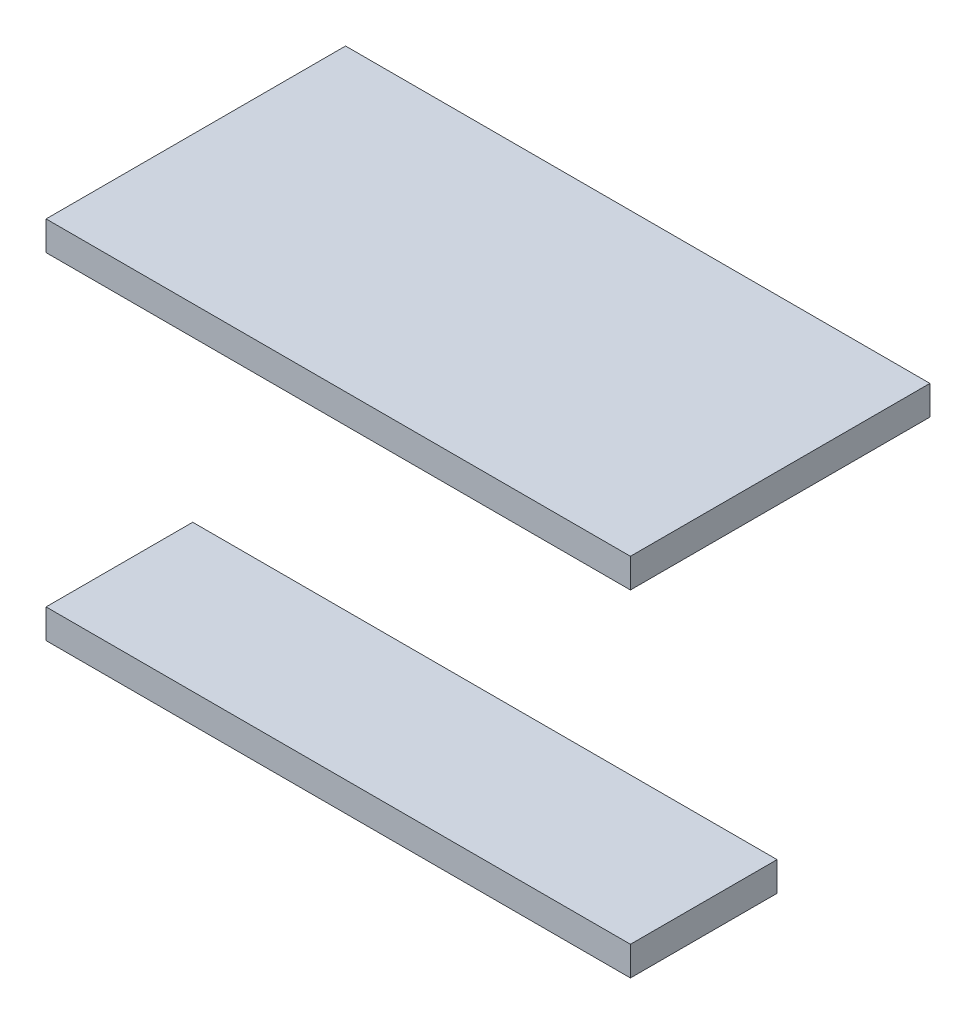
ISO-10303-21;
HEADER;
FILE_DESCRIPTION(('STEP AP214'),'2;1');
FILE_NAME('part.step','',(''),(''),'','','');
FILE_SCHEMA(('AUTOMOTIVE_DESIGN { 1 0 10303 214 1 1 1 1 }'));
ENDSEC;
DATA;
#1=APPLICATION_CONTEXT('core data for automotive mechanical design processes');
#2=APPLICATION_PROTOCOL_DEFINITION('international standard','automotive_design',2000,#1);
#3=PRODUCT_CONTEXT('',#1,'mechanical');
#4=PRODUCT('Part','Part','',(#3));
#5=PRODUCT_RELATED_PRODUCT_CATEGORY('part','',(#4));
#6=PRODUCT_DEFINITION_FORMATION('','',#4);
#7=PRODUCT_DEFINITION_CONTEXT('part definition',#1,'design');
#8=PRODUCT_DEFINITION('design','',#6,#7);
#9=PRODUCT_DEFINITION_SHAPE('','',#8);
#10=(LENGTH_UNIT() NAMED_UNIT(*) SI_UNIT(.MILLI.,.METRE.));
#11=(NAMED_UNIT(*) PLANE_ANGLE_UNIT() SI_UNIT($,.RADIAN.));
#12=(NAMED_UNIT(*) SI_UNIT($,.STERADIAN.) SOLID_ANGLE_UNIT());
#13=UNCERTAINTY_MEASURE_WITH_UNIT(LENGTH_MEASURE(1.E-05),#10,'distance_accuracy_value','');
#14=(GEOMETRIC_REPRESENTATION_CONTEXT(3) GLOBAL_UNCERTAINTY_ASSIGNED_CONTEXT((#13)) GLOBAL_UNIT_ASSIGNED_CONTEXT((#10,
#11,#12)) REPRESENTATION_CONTEXT('',''));
#15=CARTESIAN_POINT('',(0.,0.,0.));
#16=DIRECTION('',(0.,0.,1.));
#17=DIRECTION('',(1.,0.,0.));
#18=AXIS2_PLACEMENT_3D('',#15,#16,#17);
#19=CARTESIAN_POINT('',(-240.,0.,-12.));
#20=DIRECTION('',(0.,1.,0.));
#21=DIRECTION('',(0.,0.,1.));
#22=AXIS2_PLACEMENT_3D('',#19,#20,#21);
#23=PLANE('',#22);
#24=DIRECTION('',(0.,0.,1.));
#25=VECTOR('',#24,1.);
#26=CARTESIAN_POINT('',(0.,0.,-12.));
#27=LINE('',#26,#25);
#28=CARTESIAN_POINT('',(0.,0.,-135.));
#29=VERTEX_POINT('',#28);
#30=CARTESIAN_POINT('',(0.,0.,-12.));
#31=VERTEX_POINT('',#30);
#32=EDGE_CURVE('E107',#29,#31,#27,.T.);
#33=ORIENTED_EDGE('',*,*,#32,.F.);
#34=DIRECTION('',(1.,0.,0.));
#35=VECTOR('',#34,1.);
#36=CARTESIAN_POINT('',(-240.,0.,-135.));
#37=LINE('',#36,#35);
#38=CARTESIAN_POINT('',(-240.,0.,-135.));
#39=VERTEX_POINT('',#38);
#40=EDGE_CURVE('E12',#39,#29,#37,.T.);
#41=ORIENTED_EDGE('',*,*,#40,.F.);
#42=DIRECTION('',(0.,0.,1.));
#43=VECTOR('',#42,1.);
#44=CARTESIAN_POINT('',(-240.,0.,-12.));
#45=LINE('',#44,#43);
#46=CARTESIAN_POINT('',(-240.,0.,-12.));
#47=VERTEX_POINT('',#46);
#48=EDGE_CURVE('E101',#39,#47,#45,.T.);
#49=ORIENTED_EDGE('',*,*,#48,.T.);
#50=DIRECTION('',(1.,0.,0.));
#51=VECTOR('',#50,1.);
#52=CARTESIAN_POINT('',(-240.,0.,-12.));
#53=LINE('',#52,#51);
#54=EDGE_CURVE('E46',#47,#31,#53,.T.);
#55=ORIENTED_EDGE('',*,*,#54,.T.);
#56=EDGE_LOOP('',(#33,#41,#49,#55));
#57=FACE_BOUND('',#56,.T.);
#58=ADVANCED_FACE('F43',(#57),#23,.T.);
#59=CARTESIAN_POINT('',(-240.,0.,-135.));
#60=DIRECTION('',(0.,0.,-1.));
#61=DIRECTION('',(-1.,0.,0.));
#62=AXIS2_PLACEMENT_3D('',#59,#60,#61);
#63=PLANE('',#62);
#64=DIRECTION('',(0.,1.,0.));
#65=VECTOR('',#64,1.);
#66=CARTESIAN_POINT('',(0.,0.,-135.));
#67=LINE('',#66,#65);
#68=CARTESIAN_POINT('',(0.,-12.,-135.));
#69=VERTEX_POINT('',#68);
#70=EDGE_CURVE('E103',#69,#29,#67,.T.);
#71=ORIENTED_EDGE('',*,*,#70,.F.);
#72=DIRECTION('',(1.,0.,0.));
#73=VECTOR('',#72,1.);
#74=CARTESIAN_POINT('',(-240.,-12.,-135.));
#75=LINE('',#74,#73);
#76=CARTESIAN_POINT('',(-240.,-12.,-135.));
#77=VERTEX_POINT('',#76);
#78=EDGE_CURVE('E52',#77,#69,#75,.T.);
#79=ORIENTED_EDGE('',*,*,#78,.F.);
#80=DIRECTION('',(0.,1.,0.));
#81=VECTOR('',#80,1.);
#82=CARTESIAN_POINT('',(-240.,0.,-135.));
#83=LINE('',#82,#81);
#84=EDGE_CURVE('E98',#77,#39,#83,.T.);
#85=ORIENTED_EDGE('',*,*,#84,.T.);
#86=ORIENTED_EDGE('',*,*,#40,.T.);
#87=EDGE_LOOP('',(#71,#79,#85,#86));
#88=FACE_BOUND('',#87,.T.);
#89=ADVANCED_FACE('F117',(#88),#63,.T.);
#90=CARTESIAN_POINT('',(-240.,-12.,-12.));
#91=DIRECTION('',(0.,-1.,0.));
#92=DIRECTION('',(0.,0.,-1.));
#93=AXIS2_PLACEMENT_3D('',#90,#91,#92);
#94=PLANE('',#93);
#95=DIRECTION('',(0.,0.,-1.));
#96=VECTOR('',#95,1.);
#97=CARTESIAN_POINT('',(0.,-12.,-12.));
#98=LINE('',#97,#96);
#99=CARTESIAN_POINT('',(0.,-12.,-12.));
#100=VERTEX_POINT('',#99);
#101=EDGE_CURVE('E93',#100,#69,#98,.T.);
#102=ORIENTED_EDGE('',*,*,#101,.F.);
#103=DIRECTION('',(1.,0.,0.));
#104=VECTOR('',#103,1.);
#105=CARTESIAN_POINT('',(-240.,-12.,-12.));
#106=LINE('',#105,#104);
#107=CARTESIAN_POINT('',(-240.,-12.,-12.));
#108=VERTEX_POINT('',#107);
#109=EDGE_CURVE('E88',#108,#100,#106,.T.);
#110=ORIENTED_EDGE('',*,*,#109,.F.);
#111=DIRECTION('',(0.,0.,-1.));
#112=VECTOR('',#111,1.);
#113=CARTESIAN_POINT('',(-240.,-12.,-12.));
#114=LINE('',#113,#112);
#115=EDGE_CURVE('E91',#108,#77,#114,.T.);
#116=ORIENTED_EDGE('',*,*,#115,.T.);
#117=ORIENTED_EDGE('',*,*,#78,.T.);
#118=EDGE_LOOP('',(#102,#110,#116,#117));
#119=FACE_BOUND('',#118,.T.);
#120=ADVANCED_FACE('F90',(#119),#94,.T.);
#121=CARTESIAN_POINT('',(-240.,-12.,-12.));
#122=DIRECTION('',(0.,0.,1.));
#123=DIRECTION('',(1.,0.,0.));
#124=AXIS2_PLACEMENT_3D('',#121,#122,#123);
#125=PLANE('',#124);
#126=DIRECTION('',(0.,-1.,0.));
#127=VECTOR('',#126,1.);
#128=CARTESIAN_POINT('',(0.,-12.,-12.));
#129=LINE('',#128,#127);
#130=EDGE_CURVE('E110',#31,#100,#129,.T.);
#131=ORIENTED_EDGE('',*,*,#130,.F.);
#132=ORIENTED_EDGE('',*,*,#54,.F.);
#133=DIRECTION('',(0.,-1.,0.));
#134=VECTOR('',#133,1.);
#135=CARTESIAN_POINT('',(-240.,-12.,-12.));
#136=LINE('',#135,#134);
#137=EDGE_CURVE('E97',#47,#108,#136,.T.);
#138=ORIENTED_EDGE('',*,*,#137,.T.);
#139=ORIENTED_EDGE('',*,*,#109,.T.);
#140=EDGE_LOOP('',(#131,#132,#138,#139));
#141=FACE_BOUND('',#140,.T.);
#142=ADVANCED_FACE('F100',(#141),#125,.T.);
#143=CARTESIAN_POINT('',(-240.,0.,0.));
#144=DIRECTION('',(-1.,0.,0.));
#145=DIRECTION('',(0.,0.,1.));
#146=AXIS2_PLACEMENT_3D('',#143,#144,#145);
#147=PLANE('',#146);
#148=ORIENTED_EDGE('',*,*,#48,.F.);
#149=ORIENTED_EDGE('',*,*,#84,.F.);
#150=ORIENTED_EDGE('',*,*,#115,.F.);
#151=ORIENTED_EDGE('',*,*,#137,.F.);
#152=EDGE_LOOP('',(#148,#149,#150,#151));
#153=FACE_BOUND('',#152,.T.);
#154=ADVANCED_FACE('F96',(#153),#147,.T.);
#155=CARTESIAN_POINT('',(0.,0.,0.));
#156=DIRECTION('',(-1.,0.,0.));
#157=DIRECTION('',(0.,0.,1.));
#158=AXIS2_PLACEMENT_3D('',#155,#156,#157);
#159=PLANE('',#158);
#160=ORIENTED_EDGE('',*,*,#32,.T.);
#161=ORIENTED_EDGE('',*,*,#130,.T.);
#162=ORIENTED_EDGE('',*,*,#101,.T.);
#163=ORIENTED_EDGE('',*,*,#70,.T.);
#164=EDGE_LOOP('',(#160,#161,#162,#163));
#165=FACE_BOUND('',#164,.T.);
#166=ADVANCED_FACE('F116',(#165),#159,.F.);
#167=CLOSED_SHELL('',(#58,#89,#120,#142,#154,#166));
#168=MANIFOLD_SOLID_BREP('B2',#167);
#169=CARTESIAN_POINT('',(-240.,-150.,-12.));
#170=DIRECTION('',(0.,-1.,0.));
#171=DIRECTION('',(0.,0.,-1.));
#172=AXIS2_PLACEMENT_3D('',#169,#170,#171);
#173=PLANE('',#172);
#174=DIRECTION('',(0.,0.,-1.));
#175=VECTOR('',#174,1.);
#176=CARTESIAN_POINT('',(0.,-150.,-12.));
#177=LINE('',#176,#175);
#178=CARTESIAN_POINT('',(0.,-150.,-12.));
#179=VERTEX_POINT('',#178);
#180=CARTESIAN_POINT('',(0.,-150.,-72.2241743111136));
#181=VERTEX_POINT('',#180);
#182=EDGE_CURVE('E231',#179,#181,#177,.T.);
#183=ORIENTED_EDGE('',*,*,#182,.F.);
#184=DIRECTION('',(1.,0.,0.));
#185=VECTOR('',#184,1.);
#186=CARTESIAN_POINT('',(-240.,-150.,-12.));
#187=LINE('',#186,#185);
#188=CARTESIAN_POINT('',(-240.,-150.,-12.));
#189=VERTEX_POINT('',#188);
#190=EDGE_CURVE('E41',#189,#179,#187,.T.);
#191=ORIENTED_EDGE('',*,*,#190,.F.);
#192=DIRECTION('',(0.,0.,-1.));
#193=VECTOR('',#192,1.);
#194=CARTESIAN_POINT('',(-240.,-150.,-12.));
#195=LINE('',#194,#193);
#196=CARTESIAN_POINT('',(-240.,-150.,-72.2241743111136));
#197=VERTEX_POINT('',#196);
#198=EDGE_CURVE('E225',#189,#197,#195,.T.);
#199=ORIENTED_EDGE('',*,*,#198,.T.);
#200=DIRECTION('',(1.,0.,0.));
#201=VECTOR('',#200,1.);
#202=CARTESIAN_POINT('',(-240.,-150.,-72.2241743111136));
#203=LINE('',#202,#201);
#204=EDGE_CURVE('E170',#197,#181,#203,.T.);
#205=ORIENTED_EDGE('',*,*,#204,.T.);
#206=EDGE_LOOP('',(#183,#191,#199,#205));
#207=FACE_BOUND('',#206,.T.);
#208=ADVANCED_FACE('F167',(#207),#173,.T.);
#209=CARTESIAN_POINT('',(-240.,-138.,-12.));
#210=DIRECTION('',(0.,0.,1.));
#211=DIRECTION('',(0.,-1.,0.));
#212=AXIS2_PLACEMENT_3D('',#209,#210,#211);
#213=PLANE('',#212);
#214=DIRECTION('',(0.,-1.,0.));
#215=VECTOR('',#214,1.);
#216=CARTESIAN_POINT('',(0.,-138.,-12.));
#217=LINE('',#216,#215);
#218=CARTESIAN_POINT('',(0.,-138.,-12.));
#219=VERTEX_POINT('',#218);
#220=EDGE_CURVE('E227',#219,#179,#217,.T.);
#221=ORIENTED_EDGE('',*,*,#220,.F.);
#222=DIRECTION('',(1.,0.,0.));
#223=VECTOR('',#222,1.);
#224=CARTESIAN_POINT('',(-240.,-138.,-12.));
#225=LINE('',#224,#223);
#226=CARTESIAN_POINT('',(-240.,-138.,-12.));
#227=VERTEX_POINT('',#226);
#228=EDGE_CURVE('E176',#227,#219,#225,.T.);
#229=ORIENTED_EDGE('',*,*,#228,.F.);
#230=DIRECTION('',(0.,-1.,0.));
#231=VECTOR('',#230,1.);
#232=CARTESIAN_POINT('',(-240.,-138.,-12.));
#233=LINE('',#232,#231);
#234=EDGE_CURVE('E222',#227,#189,#233,.T.);
#235=ORIENTED_EDGE('',*,*,#234,.T.);
#236=ORIENTED_EDGE('',*,*,#190,.T.);
#237=EDGE_LOOP('',(#221,#229,#235,#236));
#238=FACE_BOUND('',#237,.T.);
#239=ADVANCED_FACE('F241',(#238),#213,.T.);
#240=CARTESIAN_POINT('',(-240.,-138.,-12.));
#241=DIRECTION('',(0.,1.,0.));
#242=DIRECTION('',(0.,0.,1.));
#243=AXIS2_PLACEMENT_3D('',#240,#241,#242);
#244=PLANE('',#243);
#245=DIRECTION('',(0.,0.,1.));
#246=VECTOR('',#245,1.);
#247=CARTESIAN_POINT('',(0.,-138.,-12.));
#248=LINE('',#247,#246);
#249=CARTESIAN_POINT('',(0.,-138.,-72.2241743111136));
#250=VERTEX_POINT('',#249);
#251=EDGE_CURVE('E217',#250,#219,#248,.T.);
#252=ORIENTED_EDGE('',*,*,#251,.F.);
#253=DIRECTION('',(1.,0.,0.));
#254=VECTOR('',#253,1.);
#255=CARTESIAN_POINT('',(-240.,-138.,-72.2241743111136));
#256=LINE('',#255,#254);
#257=CARTESIAN_POINT('',(-240.,-138.,-72.2241743111136));
#258=VERTEX_POINT('',#257);
#259=EDGE_CURVE('E212',#258,#250,#256,.T.);
#260=ORIENTED_EDGE('',*,*,#259,.F.);
#261=DIRECTION('',(0.,0.,1.));
#262=VECTOR('',#261,1.);
#263=CARTESIAN_POINT('',(-240.,-138.,-12.));
#264=LINE('',#263,#262);
#265=EDGE_CURVE('E215',#258,#227,#264,.T.);
#266=ORIENTED_EDGE('',*,*,#265,.T.);
#267=ORIENTED_EDGE('',*,*,#228,.T.);
#268=EDGE_LOOP('',(#252,#260,#266,#267));
#269=FACE_BOUND('',#268,.T.);
#270=ADVANCED_FACE('F214',(#269),#244,.T.);
#271=CARTESIAN_POINT('',(-240.,-138.,-72.2241743111136));
#272=DIRECTION('',(0.,0.,-1.));
#273=DIRECTION('',(-1.,0.,0.));
#274=AXIS2_PLACEMENT_3D('',#271,#272,#273);
#275=PLANE('',#274);
#276=DIRECTION('',(0.,1.,0.));
#277=VECTOR('',#276,1.);
#278=CARTESIAN_POINT('',(0.,-138.,-72.2241743111136));
#279=LINE('',#278,#277);
#280=EDGE_CURVE('E234',#181,#250,#279,.T.);
#281=ORIENTED_EDGE('',*,*,#280,.F.);
#282=ORIENTED_EDGE('',*,*,#204,.F.);
#283=DIRECTION('',(0.,1.,0.));
#284=VECTOR('',#283,1.);
#285=CARTESIAN_POINT('',(-240.,-138.,-72.2241743111136));
#286=LINE('',#285,#284);
#287=EDGE_CURVE('E221',#197,#258,#286,.T.);
#288=ORIENTED_EDGE('',*,*,#287,.T.);
#289=ORIENTED_EDGE('',*,*,#259,.T.);
#290=EDGE_LOOP('',(#281,#282,#288,#289));
#291=FACE_BOUND('',#290,.T.);
#292=ADVANCED_FACE('F224',(#291),#275,.T.);
#293=CARTESIAN_POINT('',(-240.,0.,0.));
#294=DIRECTION('',(-1.,0.,0.));
#295=DIRECTION('',(0.,0.,1.));
#296=AXIS2_PLACEMENT_3D('',#293,#294,#295);
#297=PLANE('',#296);
#298=ORIENTED_EDGE('',*,*,#198,.F.);
#299=ORIENTED_EDGE('',*,*,#234,.F.);
#300=ORIENTED_EDGE('',*,*,#265,.F.);
#301=ORIENTED_EDGE('',*,*,#287,.F.);
#302=EDGE_LOOP('',(#298,#299,#300,#301));
#303=FACE_BOUND('',#302,.T.);
#304=ADVANCED_FACE('F220',(#303),#297,.T.);
#305=CARTESIAN_POINT('',(0.,0.,0.));
#306=DIRECTION('',(-1.,0.,0.));
#307=DIRECTION('',(0.,0.,1.));
#308=AXIS2_PLACEMENT_3D('',#305,#306,#307);
#309=PLANE('',#308);
#310=ORIENTED_EDGE('',*,*,#182,.T.);
#311=ORIENTED_EDGE('',*,*,#280,.T.);
#312=ORIENTED_EDGE('',*,*,#251,.T.);
#313=ORIENTED_EDGE('',*,*,#220,.T.);
#314=EDGE_LOOP('',(#310,#311,#312,#313));
#315=FACE_BOUND('',#314,.T.);
#316=ADVANCED_FACE('F240',(#315),#309,.F.);
#317=CLOSED_SHELL('',(#208,#239,#270,#292,#304,#316));
#318=MANIFOLD_SOLID_BREP('B6',#317);
#319=ADVANCED_BREP_SHAPE_REPRESENTATION('',(#18,#168,#318),#14);
#320=SHAPE_DEFINITION_REPRESENTATION(#9,#319);
ENDSEC;
END-ISO-10303-21;
